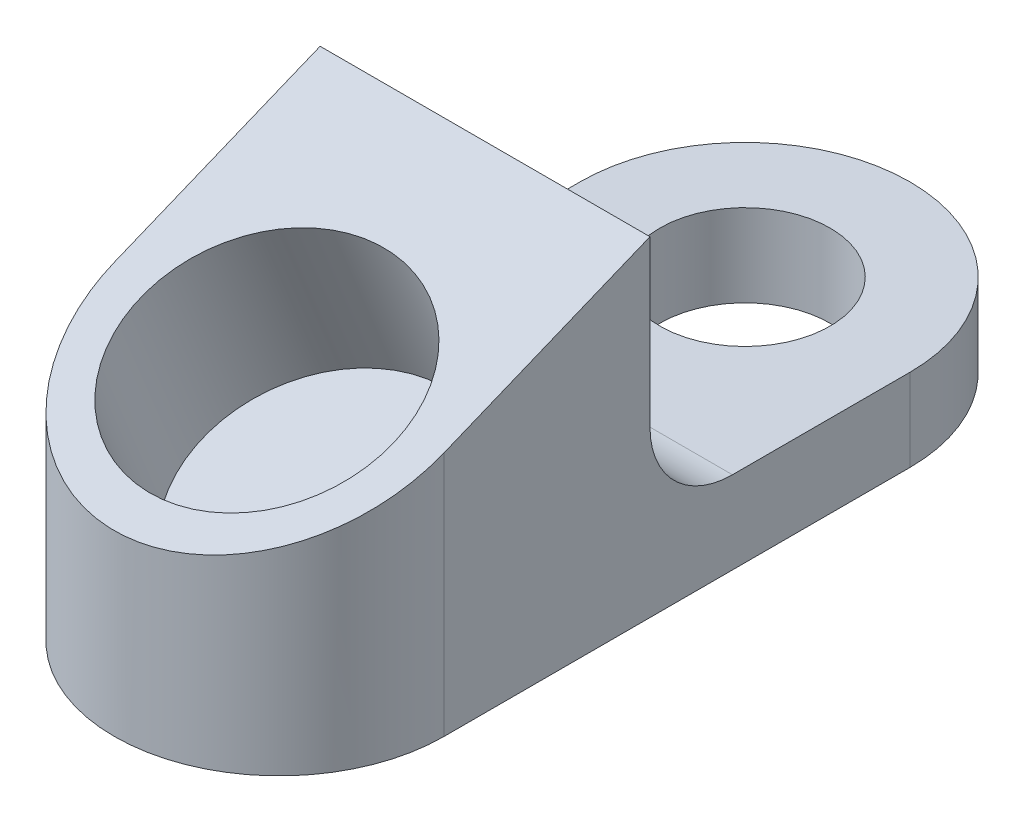
ISO-10303-21;
HEADER;
FILE_DESCRIPTION(('STEP AP214'),'2;1');
FILE_NAME('part.step','',(''),(''),'','','');
FILE_SCHEMA(('AUTOMOTIVE_DESIGN { 1 0 10303 214 1 1 1 1 }'));
ENDSEC;
DATA;
#1=APPLICATION_CONTEXT('core data for automotive mechanical design processes');
#2=APPLICATION_PROTOCOL_DEFINITION('international standard','automotive_design',2000,#1);
#3=PRODUCT_CONTEXT('',#1,'mechanical');
#4=PRODUCT('Part','Part','',(#3));
#5=PRODUCT_RELATED_PRODUCT_CATEGORY('part','',(#4));
#6=PRODUCT_DEFINITION_FORMATION('','',#4);
#7=PRODUCT_DEFINITION_CONTEXT('part definition',#1,'design');
#8=PRODUCT_DEFINITION('design','',#6,#7);
#9=PRODUCT_DEFINITION_SHAPE('','',#8);
#10=(LENGTH_UNIT() NAMED_UNIT(*) SI_UNIT(.MILLI.,.METRE.));
#11=(NAMED_UNIT(*) PLANE_ANGLE_UNIT() SI_UNIT($,.RADIAN.));
#12=(NAMED_UNIT(*) SI_UNIT($,.STERADIAN.) SOLID_ANGLE_UNIT());
#13=UNCERTAINTY_MEASURE_WITH_UNIT(LENGTH_MEASURE(1.E-05),#10,'distance_accuracy_value','');
#14=(GEOMETRIC_REPRESENTATION_CONTEXT(3) GLOBAL_UNCERTAINTY_ASSIGNED_CONTEXT((#13)) GLOBAL_UNIT_ASSIGNED_CONTEXT((#10,
#11,#12)) REPRESENTATION_CONTEXT('',''));
#15=CARTESIAN_POINT('',(0.,0.,0.));
#16=DIRECTION('',(0.,0.,1.));
#17=DIRECTION('',(1.,0.,0.));
#18=AXIS2_PLACEMENT_3D('',#15,#16,#17);
#19=CARTESIAN_POINT('',(-12.7,18.9182543176429,15.85325428724));
#20=DIRECTION('',(0.,-1.,0.));
#21=DIRECTION('',(-0.694488610466601,0.,-0.719503696955179));
#22=AXIS2_PLACEMENT_3D('',#19,#20,#21);
#23=CYLINDRICAL_SURFACE('',#22,12.7);
#24=DIRECTION('',(0.,1.,0.));
#25=VECTOR('',#24,1.);
#26=CARTESIAN_POINT('',(0.,18.9182543176429,15.85325428724));
#27=LINE('',#26,#25);
#28=CARTESIAN_POINT('',(0.,18.918254317643,15.85325428724));
#29=VERTEX_POINT('',#28);
#30=CARTESIAN_POINT('',(0.,0.,15.85325428724));
#31=VERTEX_POINT('',#30);
#32=EDGE_CURVE('E148',#29,#31,#27,.F.);
#33=ORIENTED_EDGE('',*,*,#32,.F.);
#34=CARTESIAN_POINT('',(-12.7,18.9182543176429,15.85325428724));
#35=DIRECTION('',(0.,-0.925622164240067,-0.37844895173264));
#36=DIRECTION('',(0.,-0.37844895173264,0.925622164240067));
#37=AXIS2_PLACEMENT_3D('',#34,#35,#36);
#38=ELLIPSE('',#37,13.7205011835759,12.7);
#39=CARTESIAN_POINT('',(-25.3999999999999,18.9182543176429,15.85325428724));
#40=VERTEX_POINT('',#39);
#41=EDGE_CURVE('E121',#40,#29,#38,.F.);
#42=ORIENTED_EDGE('',*,*,#41,.F.);
#43=DIRECTION('',(0.,-1.,0.));
#44=VECTOR('',#43,1.);
#45=CARTESIAN_POINT('',(-25.4,-3.17499999999935,15.8532542872399));
#46=LINE('',#45,#44);
#47=CARTESIAN_POINT('',(-25.4,0.,15.8532542872399));
#48=VERTEX_POINT('',#47);
#49=EDGE_CURVE('E150',#48,#40,#46,.F.);
#50=ORIENTED_EDGE('',*,*,#49,.F.);
#51=CARTESIAN_POINT('',(-12.7,0.,15.8532542872399));
#52=DIRECTION('',(0.,1.,0.));
#53=DIRECTION('',(0.694488610466601,0.,0.719503696955179));
#54=AXIS2_PLACEMENT_3D('',#51,#52,#53);
#55=CIRCLE('',#54,12.7);
#56=EDGE_CURVE('E154',#31,#48,#55,.F.);
#57=ORIENTED_EDGE('',*,*,#56,.F.);
#58=EDGE_LOOP('',(#33,#42,#50,#57));
#59=FACE_BOUND('',#58,.T.);
#60=ADVANCED_FACE('F39',(#59),#23,.T.);
#61=CARTESIAN_POINT('',(-12.7,0.,-20.0172685944428));
#62=DIRECTION('',(0.,1.,0.));
#63=DIRECTION('',(0.694488610466601,0.,0.719503696955179));
#64=AXIS2_PLACEMENT_3D('',#61,#62,#63);
#65=CYLINDRICAL_SURFACE('',#64,12.7);
#66=DIRECTION('',(0.,-1.,0.));
#67=VECTOR('',#66,1.);
#68=CARTESIAN_POINT('',(0.,0.,-20.0172685944429));
#69=LINE('',#68,#67);
#70=CARTESIAN_POINT('',(0.,0.,-20.0172685944429));
#71=VERTEX_POINT('',#70);
#72=CARTESIAN_POINT('',(0.,6.34999999999999,-20.0172685944428));
#73=VERTEX_POINT('',#72);
#74=EDGE_CURVE('E117',#71,#73,#69,.F.);
#75=ORIENTED_EDGE('',*,*,#74,.F.);
#76=CARTESIAN_POINT('',(-12.7,0.,-20.0172685944428));
#77=DIRECTION('',(0.,1.,0.));
#78=DIRECTION('',(0.694488610466601,0.,0.719503696955179));
#79=AXIS2_PLACEMENT_3D('',#76,#77,#78);
#80=CIRCLE('',#79,12.7);
#81=CARTESIAN_POINT('',(-25.4,0.,-20.0172685944428));
#82=VERTEX_POINT('',#81);
#83=EDGE_CURVE('E143',#82,#71,#80,.F.);
#84=ORIENTED_EDGE('',*,*,#83,.F.);
#85=DIRECTION('',(0.,1.,0.));
#86=VECTOR('',#85,1.);
#87=CARTESIAN_POINT('',(-25.4,-3.17500000000001,-20.0172685944429));
#88=LINE('',#87,#86);
#89=CARTESIAN_POINT('',(-25.4,6.34999999999999,-20.0172685944428));
#90=VERTEX_POINT('',#89);
#91=EDGE_CURVE('E140',#90,#82,#88,.F.);
#92=ORIENTED_EDGE('',*,*,#91,.F.);
#93=CARTESIAN_POINT('',(-12.7,6.34999999999999,-20.0172685944428));
#94=DIRECTION('',(0.,-1.,0.));
#95=DIRECTION('',(-0.694488610466601,0.,-0.719503696955179));
#96=AXIS2_PLACEMENT_3D('',#93,#94,#95);
#97=CIRCLE('',#96,12.7);
#98=EDGE_CURVE('E146',#73,#90,#97,.F.);
#99=ORIENTED_EDGE('',*,*,#98,.F.);
#100=EDGE_LOOP('',(#75,#84,#92,#99));
#101=FACE_BOUND('',#100,.T.);
#102=ADVANCED_FACE('F170',(#101),#65,.T.);
#103=CARTESIAN_POINT('',(0.,6.34999999999999,-32.7172685944428));
#104=DIRECTION('',(0.,-1.,0.));
#105=DIRECTION('',(-0.694488610466601,0.,-0.719503696955179));
#106=AXIS2_PLACEMENT_3D('',#103,#104,#105);
#107=PLANE('',#106);
#108=CARTESIAN_POINT('',(-12.7000000000001,6.34999999999998,-20.0172685944428));
#109=DIRECTION('',(0.,1.,0.));
#110=DIRECTION('',(0.694488610466601,0.,0.719503696955179));
#111=AXIS2_PLACEMENT_3D('',#108,#109,#110);
#112=CIRCLE('',#111,6.5484375);
#113=CARTESIAN_POINT('',(-8.15218473989767,6.34999999999998,-15.3056436039129));
#114=VERTEX_POINT('',#113);
#115=EDGE_CURVE('E137',#114,#114,#112,.T.);
#116=ORIENTED_EDGE('',*,*,#115,.F.);
#117=EDGE_LOOP('',(#116));
#118=FACE_BOUND('',#117,.T.);
#119=DIRECTION('',(0.,0.,1.));
#120=VECTOR('',#119,1.);
#121=CARTESIAN_POINT('',(-25.4,6.34999999999999,-32.7172685944429));
#122=LINE('',#121,#120);
#123=CARTESIAN_POINT('',(-25.4,6.34999999999999,-6.35000000000005));
#124=VERTEX_POINT('',#123);
#125=EDGE_CURVE('E127',#90,#124,#122,.T.);
#126=ORIENTED_EDGE('',*,*,#125,.T.);
#127=DIRECTION('',(-1.,0.,0.));
#128=VECTOR('',#127,1.);
#129=CARTESIAN_POINT('',(0.,6.34999999999999,-6.34999999999999));
#130=LINE('',#129,#128);
#131=CARTESIAN_POINT('',(0.,6.34999999999999,-6.34999999999999));
#132=VERTEX_POINT('',#131);
#133=EDGE_CURVE('E60',#124,#132,#130,.F.);
#134=ORIENTED_EDGE('',*,*,#133,.T.);
#135=DIRECTION('',(0.,0.,1.));
#136=VECTOR('',#135,1.);
#137=CARTESIAN_POINT('',(0.,6.34999999999999,-32.7172685944428));
#138=LINE('',#137,#136);
#139=EDGE_CURVE('E108',#73,#132,#138,.T.);
#140=ORIENTED_EDGE('',*,*,#139,.F.);
#141=ORIENTED_EDGE('',*,*,#98,.T.);
#142=EDGE_LOOP('',(#126,#134,#140,#141));
#143=FACE_BOUND('',#142,.T.);
#144=ADVANCED_FACE('F171',(#118,#143),#107,.F.);
#145=CARTESIAN_POINT('',(0.,6.34999999999999,0.));
#146=DIRECTION('',(0.,0.,1.));
#147=DIRECTION('',(1.,0.,0.));
#148=AXIS2_PLACEMENT_3D('',#145,#146,#147);
#149=PLANE('',#148);
#150=DIRECTION('',(0.,1.,0.));
#151=VECTOR('',#150,1.);
#152=CARTESIAN_POINT('',(0.,6.34999999999999,0.));
#153=LINE('',#152,#151);
#154=CARTESIAN_POINT('',(0.,12.7,0.));
#155=VERTEX_POINT('',#154);
#156=CARTESIAN_POINT('',(0.,25.4,0.));
#157=VERTEX_POINT('',#156);
#158=EDGE_CURVE('E98',#155,#157,#153,.T.);
#159=ORIENTED_EDGE('',*,*,#158,.F.);
#160=DIRECTION('',(-1.,0.,0.));
#161=VECTOR('',#160,1.);
#162=CARTESIAN_POINT('',(-25.4,12.7,0.));
#163=LINE('',#162,#161);
#164=CARTESIAN_POINT('',(-25.4,12.7,0.));
#165=VERTEX_POINT('',#164);
#166=EDGE_CURVE('E156',#155,#165,#163,.T.);
#167=ORIENTED_EDGE('',*,*,#166,.T.);
#168=DIRECTION('',(0.,1.,0.));
#169=VECTOR('',#168,1.);
#170=CARTESIAN_POINT('',(-25.4,6.34999999999999,0.));
#171=LINE('',#170,#169);
#172=CARTESIAN_POINT('',(-25.4,25.4,0.));
#173=VERTEX_POINT('',#172);
#174=EDGE_CURVE('E113',#165,#173,#171,.T.);
#175=ORIENTED_EDGE('',*,*,#174,.T.);
#176=DIRECTION('',(-1.,0.,0.));
#177=VECTOR('',#176,1.);
#178=CARTESIAN_POINT('',(0.,25.4,0.));
#179=LINE('',#178,#177);
#180=EDGE_CURVE('E111',#157,#173,#179,.T.);
#181=ORIENTED_EDGE('',*,*,#180,.F.);
#182=EDGE_LOOP('',(#159,#167,#175,#181));
#183=FACE_BOUND('',#182,.T.);
#184=ADVANCED_FACE('F112',(#183),#149,.F.);
#185=CARTESIAN_POINT('',(0.,14.9273204492233,25.6144039157778));
#186=DIRECTION('',(0.,-0.925622164240067,-0.37844895173264));
#187=DIRECTION('',(-0.666257967930191,0.282217460229327,-0.690256202660463));
#188=AXIS2_PLACEMENT_3D('',#185,#186,#187);
#189=PLANE('',#188);
#190=CARTESIAN_POINT('',(-12.7,18.5320467144767,16.7978528013911));
#191=DIRECTION('',(0.,0.925622164240067,0.37844895173264));
#192=DIRECTION('',(0.666257967930191,-0.282217460229327,0.690256202660463));
#193=AXIS2_PLACEMENT_3D('',#190,#191,#192);
#194=CIRCLE('',#193,9.72343749999999);
#195=CARTESIAN_POINT('',(-6.22168228995379,15.7879228785281,23.5095158469474));
#196=VERTEX_POINT('',#195);
#197=EDGE_CURVE('E176',#196,#196,#194,.T.);
#198=ORIENTED_EDGE('',*,*,#197,.F.);
#199=EDGE_LOOP('',(#198));
#200=FACE_BOUND('',#199,.T.);
#201=DIRECTION('',(0.,-0.37844895173264,0.925622164240067));
#202=VECTOR('',#201,1.);
#203=CARTESIAN_POINT('',(-25.4,14.9273204492233,25.6144039157777));
#204=LINE('',#203,#202);
#205=EDGE_CURVE('E131',#173,#40,#204,.T.);
#206=ORIENTED_EDGE('',*,*,#205,.T.);
#207=ORIENTED_EDGE('',*,*,#41,.T.);
#208=DIRECTION('',(0.,-0.378448951732644,0.925622164240066));
#209=VECTOR('',#208,1.);
#210=CARTESIAN_POINT('',(0.,25.4,0.));
#211=LINE('',#210,#209);
#212=EDGE_CURVE('E103',#157,#29,#211,.T.);
#213=ORIENTED_EDGE('',*,*,#212,.F.);
#214=ORIENTED_EDGE('',*,*,#180,.T.);
#215=EDGE_LOOP('',(#206,#207,#213,#214));
#216=FACE_BOUND('',#215,.T.);
#217=ADVANCED_FACE('F120',(#200,#216),#189,.F.);
#218=CARTESIAN_POINT('',(0.,0.,28.5532542872399));
#219=DIRECTION('',(0.,1.,0.));
#220=DIRECTION('',(0.694488610466601,0.,0.719503696955179));
#221=AXIS2_PLACEMENT_3D('',#218,#219,#220);
#222=PLANE('',#221);
#223=CARTESIAN_POINT('',(-12.7000000000001,0.,-20.0172685944428));
#224=DIRECTION('',(0.,1.,0.));
#225=DIRECTION('',(0.694488610466601,0.,0.719503696955179));
#226=AXIS2_PLACEMENT_3D('',#223,#224,#225);
#227=CIRCLE('',#226,6.5484375);
#228=CARTESIAN_POINT('',(-8.15218473989767,0.,-15.3056436039129));
#229=VERTEX_POINT('',#228);
#230=EDGE_CURVE('E129',#229,#229,#227,.T.);
#231=ORIENTED_EDGE('',*,*,#230,.T.);
#232=EDGE_LOOP('',(#231));
#233=FACE_BOUND('',#232,.T.);
#234=DIRECTION('',(0.,0.,-1.));
#235=VECTOR('',#234,1.);
#236=CARTESIAN_POINT('',(0.,0.,28.5532542872399));
#237=LINE('',#236,#235);
#238=EDGE_CURVE('E118',#31,#71,#237,.T.);
#239=ORIENTED_EDGE('',*,*,#238,.F.);
#240=ORIENTED_EDGE('',*,*,#56,.T.);
#241=DIRECTION('',(0.,0.,-1.));
#242=VECTOR('',#241,1.);
#243=CARTESIAN_POINT('',(-25.4,0.,28.5532542872399));
#244=LINE('',#243,#242);
#245=EDGE_CURVE('E133',#48,#82,#244,.T.);
#246=ORIENTED_EDGE('',*,*,#245,.T.);
#247=ORIENTED_EDGE('',*,*,#83,.T.);
#248=EDGE_LOOP('',(#239,#240,#246,#247));
#249=FACE_BOUND('',#248,.T.);
#250=ADVANCED_FACE('F165',(#233,#249),#222,.F.);
#251=CARTESIAN_POINT('',(0.,-3.17500000000001,248.09633942639));
#252=DIRECTION('',(1.,0.,0.));
#253=DIRECTION('',(0.,0.,-1.));
#254=AXIS2_PLACEMENT_3D('',#251,#252,#253);
#255=PLANE('',#254);
#256=ORIENTED_EDGE('',*,*,#212,.T.);
#257=ORIENTED_EDGE('',*,*,#32,.T.);
#258=ORIENTED_EDGE('',*,*,#238,.T.);
#259=ORIENTED_EDGE('',*,*,#74,.T.);
#260=ORIENTED_EDGE('',*,*,#139,.T.);
#261=CARTESIAN_POINT('',(0.,12.7,-6.34999999999999));
#262=DIRECTION('',(1.,0.,0.));
#263=DIRECTION('',(0.,0.,-1.));
#264=AXIS2_PLACEMENT_3D('',#261,#262,#263);
#265=CIRCLE('',#264,6.35);
#266=EDGE_CURVE('E11',#132,#155,#265,.F.);
#267=ORIENTED_EDGE('',*,*,#266,.T.);
#268=ORIENTED_EDGE('',*,*,#158,.T.);
#269=EDGE_LOOP('',(#256,#257,#258,#259,#260,#267,#268));
#270=FACE_BOUND('',#269,.T.);
#271=ADVANCED_FACE('F100',(#270),#255,.T.);
#272=CARTESIAN_POINT('',(-25.4,-3.17500000000001,248.09633942639));
#273=DIRECTION('',(1.,0.,0.));
#274=DIRECTION('',(0.,0.,-1.));
#275=AXIS2_PLACEMENT_3D('',#272,#273,#274);
#276=PLANE('',#275);
#277=ORIENTED_EDGE('',*,*,#245,.F.);
#278=ORIENTED_EDGE('',*,*,#49,.T.);
#279=ORIENTED_EDGE('',*,*,#205,.F.);
#280=ORIENTED_EDGE('',*,*,#174,.F.);
#281=CARTESIAN_POINT('',(-25.4,12.7,-6.35000000000005));
#282=DIRECTION('',(1.,0.,0.));
#283=DIRECTION('',(0.,0.,-1.));
#284=AXIS2_PLACEMENT_3D('',#281,#282,#283);
#285=CIRCLE('',#284,6.35);
#286=EDGE_CURVE('E47',#165,#124,#285,.T.);
#287=ORIENTED_EDGE('',*,*,#286,.T.);
#288=ORIENTED_EDGE('',*,*,#125,.F.);
#289=ORIENTED_EDGE('',*,*,#91,.T.);
#290=EDGE_LOOP('',(#277,#278,#279,#280,#287,#288,#289));
#291=FACE_BOUND('',#290,.T.);
#292=ADVANCED_FACE('F160',(#291),#276,.F.);
#293=CARTESIAN_POINT('',(-12.7000000000001,-6.77972626525347,-20.0172685944428));
#294=DIRECTION('',(0.,1.,0.));
#295=DIRECTION('',(0.694488610466601,0.,0.719503696955179));
#296=AXIS2_PLACEMENT_3D('',#293,#294,#295);
#297=CYLINDRICAL_SURFACE('',#296,6.5484375);
#298=ORIENTED_EDGE('',*,*,#115,.T.);
#299=EDGE_LOOP('',(#298));
#300=FACE_BOUND('',#299,.T.);
#301=ORIENTED_EDGE('',*,*,#230,.F.);
#302=EDGE_LOOP('',(#301));
#303=FACE_BOUND('',#302,.T.);
#304=ADVANCED_FACE('F187',(#300,#303),#297,.F.);
#305=CARTESIAN_POINT('',(-12.7,6.77664522862781,11.9915511143866));
#306=DIRECTION('',(0.,0.925622164240067,0.37844895173264));
#307=DIRECTION('',(0.66625796793019,-0.282217460229327,0.690256202660463));
#308=AXIS2_PLACEMENT_3D('',#305,#306,#307);
#309=CYLINDRICAL_SURFACE('',#308,9.72343749999999);
#310=CARTESIAN_POINT('',(-12.7,6.77664522862781,11.9915511143866));
#311=DIRECTION('',(0.,0.925622164240067,0.37844895173264));
#312=DIRECTION('',(0.666257967930191,-0.282217460229327,0.690256202660463));
#313=AXIS2_PLACEMENT_3D('',#310,#311,#312);
#314=CIRCLE('',#313,9.72343749999999);
#315=CARTESIAN_POINT('',(-6.22168228995377,4.03252139267921,18.7032141599429));
#316=VERTEX_POINT('',#315);
#317=EDGE_CURVE('E175',#316,#316,#314,.T.);
#318=ORIENTED_EDGE('',*,*,#317,.F.);
#319=EDGE_LOOP('',(#318));
#320=FACE_BOUND('',#319,.T.);
#321=ORIENTED_EDGE('',*,*,#197,.T.);
#322=EDGE_LOOP('',(#321));
#323=FACE_BOUND('',#322,.T.);
#324=ADVANCED_FACE('F184',(#320,#323),#309,.F.);
#325=CARTESIAN_POINT('',(-12.7,6.77664522862781,11.9915511143866));
#326=DIRECTION('',(0.,0.925622164240067,0.37844895173264));
#327=DIRECTION('',(0.666257967930191,-0.282217460229327,0.690256202660463));
#328=AXIS2_PLACEMENT_3D('',#325,#326,#327);
#329=PLANE('',#328);
#330=ORIENTED_EDGE('',*,*,#317,.T.);
#331=EDGE_LOOP('',(#330));
#332=FACE_BOUND('',#331,.T.);
#333=ADVANCED_FACE('F182',(#332),#329,.T.);
#334=CARTESIAN_POINT('',(0.,12.7,-6.34999999999999));
#335=DIRECTION('',(1.,0.,0.));
#336=DIRECTION('',(0.,0.,-1.));
#337=AXIS2_PLACEMENT_3D('',#334,#335,#336);
#338=CYLINDRICAL_SURFACE('',#337,6.35);
#339=ORIENTED_EDGE('',*,*,#266,.F.);
#340=ORIENTED_EDGE('',*,*,#133,.F.);
#341=ORIENTED_EDGE('',*,*,#286,.F.);
#342=ORIENTED_EDGE('',*,*,#166,.F.);
#343=EDGE_LOOP('',(#339,#340,#341,#342));
#344=FACE_BOUND('',#343,.T.);
#345=ADVANCED_FACE('F41',(#344),#338,.F.);
#346=CLOSED_SHELL('',(#60,#102,#144,#184,#217,#250,#271,#292,#304,#324,#333,#345));
#347=MANIFOLD_SOLID_BREP('B2',#346);
#348=ADVANCED_BREP_SHAPE_REPRESENTATION('',(#18,#347),#14);
#349=SHAPE_DEFINITION_REPRESENTATION(#9,#348);
ENDSEC;
END-ISO-10303-21;
